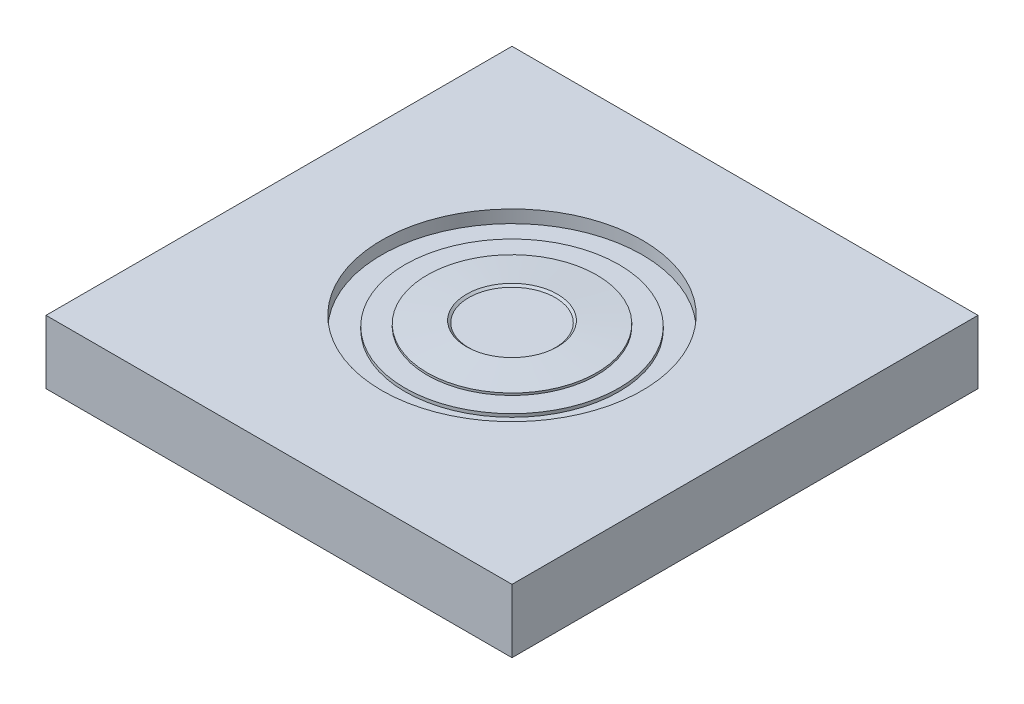
ISO-10303-21;
HEADER;
FILE_DESCRIPTION(('STEP AP214'),'2;1');
FILE_NAME('part.step','',(''),(''),'','','');
FILE_SCHEMA(('AUTOMOTIVE_DESIGN { 1 0 10303 214 1 1 1 1 }'));
ENDSEC;
DATA;
#1=APPLICATION_CONTEXT('core data for automotive mechanical design processes');
#2=APPLICATION_PROTOCOL_DEFINITION('international standard','automotive_design',2000,#1);
#3=PRODUCT_CONTEXT('',#1,'mechanical');
#4=PRODUCT('Part','Part','',(#3));
#5=PRODUCT_RELATED_PRODUCT_CATEGORY('part','',(#4));
#6=PRODUCT_DEFINITION_FORMATION('','',#4);
#7=PRODUCT_DEFINITION_CONTEXT('part definition',#1,'design');
#8=PRODUCT_DEFINITION('design','',#6,#7);
#9=PRODUCT_DEFINITION_SHAPE('','',#8);
#10=(LENGTH_UNIT() NAMED_UNIT(*) SI_UNIT(.MILLI.,.METRE.));
#11=(NAMED_UNIT(*) PLANE_ANGLE_UNIT() SI_UNIT($,.RADIAN.));
#12=(NAMED_UNIT(*) SI_UNIT($,.STERADIAN.) SOLID_ANGLE_UNIT());
#13=UNCERTAINTY_MEASURE_WITH_UNIT(LENGTH_MEASURE(1.E-05),#10,'distance_accuracy_value','');
#14=(GEOMETRIC_REPRESENTATION_CONTEXT(3) GLOBAL_UNCERTAINTY_ASSIGNED_CONTEXT((#13)) GLOBAL_UNIT_ASSIGNED_CONTEXT((#10,
#11,#12)) REPRESENTATION_CONTEXT('',''));
#15=CARTESIAN_POINT('',(0.,0.,0.));
#16=DIRECTION('',(0.,0.,1.));
#17=DIRECTION('',(1.,0.,0.));
#18=AXIS2_PLACEMENT_3D('',#15,#16,#17);
#19=CARTESIAN_POINT('',(0.,25.5,0.));
#20=DIRECTION('',(0.,1.,0.));
#21=DIRECTION('',(0.,0.,1.));
#22=AXIS2_PLACEMENT_3D('',#19,#20,#21);
#23=CYLINDRICAL_SURFACE('',#22,40.);
#24=CARTESIAN_POINT('',(0.,25.5,0.));
#25=DIRECTION('',(0.,1.,0.));
#26=DIRECTION('',(0.,0.,1.));
#27=AXIS2_PLACEMENT_3D('',#24,#25,#26);
#28=CIRCLE('',#27,40.);
#29=CARTESIAN_POINT('',(0.,25.5,40.));
#30=VERTEX_POINT('',#29);
#31=EDGE_CURVE('E122',#30,#30,#28,.T.);
#32=ORIENTED_EDGE('',*,*,#31,.T.);
#33=EDGE_LOOP('',(#32));
#34=FACE_BOUND('',#33,.T.);
#35=CARTESIAN_POINT('',(0.,26.5,0.));
#36=DIRECTION('',(0.,-1.,0.));
#37=DIRECTION('',(0.,0.,-1.));
#38=AXIS2_PLACEMENT_3D('',#35,#36,#37);
#39=CIRCLE('',#38,40.);
#40=CARTESIAN_POINT('',(0.,26.5,-40.));
#41=VERTEX_POINT('',#40);
#42=EDGE_CURVE('E119',#41,#41,#39,.F.);
#43=ORIENTED_EDGE('',*,*,#42,.F.);
#44=EDGE_LOOP('',(#43));
#45=FACE_BOUND('',#44,.T.);
#46=ADVANCED_FACE('F40',(#34,#45),#23,.T.);
#47=CARTESIAN_POINT('',(0.,24.,0.));
#48=DIRECTION('',(0.,1.,0.));
#49=DIRECTION('',(0.,0.,1.));
#50=AXIS2_PLACEMENT_3D('',#47,#48,#49);
#51=CYLINDRICAL_SURFACE('',#50,50.5);
#52=CARTESIAN_POINT('',(0.,24.,0.));
#53=DIRECTION('',(0.,1.,0.));
#54=DIRECTION('',(0.,0.,1.));
#55=AXIS2_PLACEMENT_3D('',#52,#53,#54);
#56=CIRCLE('',#55,50.5);
#57=CARTESIAN_POINT('',(0.,24.,50.5));
#58=VERTEX_POINT('',#57);
#59=EDGE_CURVE('E188',#58,#58,#56,.T.);
#60=ORIENTED_EDGE('',*,*,#59,.T.);
#61=EDGE_LOOP('',(#60));
#62=FACE_BOUND('',#61,.T.);
#63=CARTESIAN_POINT('',(0.,25.5,0.));
#64=DIRECTION('',(0.,1.,0.));
#65=DIRECTION('',(0.,0.,1.));
#66=AXIS2_PLACEMENT_3D('',#63,#64,#65);
#67=CIRCLE('',#66,50.5);
#68=CARTESIAN_POINT('',(0.,25.5,50.5));
#69=VERTEX_POINT('',#68);
#70=EDGE_CURVE('E193',#69,#69,#67,.T.);
#71=ORIENTED_EDGE('',*,*,#70,.F.);
#72=EDGE_LOOP('',(#71));
#73=FACE_BOUND('',#72,.T.);
#74=ADVANCED_FACE('F143',(#62,#73),#51,.T.);
#75=CARTESIAN_POINT('',(-110.,30.,110.));
#76=DIRECTION('',(1.,0.,0.));
#77=DIRECTION('',(0.,0.,-1.));
#78=AXIS2_PLACEMENT_3D('',#75,#76,#77);
#79=PLANE('',#78);
#80=DIRECTION('',(0.,0.,1.));
#81=VECTOR('',#80,1.);
#82=CARTESIAN_POINT('',(-110.,0.,110.));
#83=LINE('',#82,#81);
#84=CARTESIAN_POINT('',(-110.,0.,-110.));
#85=VERTEX_POINT('',#84);
#86=CARTESIAN_POINT('',(-110.,0.,110.));
#87=VERTEX_POINT('',#86);
#88=EDGE_CURVE('E109',#85,#87,#83,.T.);
#89=ORIENTED_EDGE('',*,*,#88,.T.);
#90=DIRECTION('',(0.,-1.,0.));
#91=VECTOR('',#90,1.);
#92=CARTESIAN_POINT('',(-110.,30.,110.));
#93=LINE('',#92,#91);
#94=CARTESIAN_POINT('',(-110.,30.,110.));
#95=VERTEX_POINT('',#94);
#96=EDGE_CURVE('E100',#95,#87,#93,.T.);
#97=ORIENTED_EDGE('',*,*,#96,.F.);
#98=DIRECTION('',(0.,0.,1.));
#99=VECTOR('',#98,1.);
#100=CARTESIAN_POINT('',(-110.,30.,110.));
#101=LINE('',#100,#99);
#102=CARTESIAN_POINT('',(-110.,30.,-110.));
#103=VERTEX_POINT('',#102);
#104=EDGE_CURVE('E94',#103,#95,#101,.T.);
#105=ORIENTED_EDGE('',*,*,#104,.F.);
#106=DIRECTION('',(0.,-1.,0.));
#107=VECTOR('',#106,1.);
#108=CARTESIAN_POINT('',(-110.,30.,-110.));
#109=LINE('',#108,#107);
#110=EDGE_CURVE('E105',#103,#85,#109,.T.);
#111=ORIENTED_EDGE('',*,*,#110,.T.);
#112=EDGE_LOOP('',(#89,#97,#105,#111));
#113=FACE_BOUND('',#112,.T.);
#114=ADVANCED_FACE('F149',(#113),#79,.F.);
#115=CARTESIAN_POINT('',(110.,30.,110.));
#116=DIRECTION('',(0.,0.,-1.));
#117=DIRECTION('',(-1.,0.,0.));
#118=AXIS2_PLACEMENT_3D('',#115,#116,#117);
#119=PLANE('',#118);
#120=DIRECTION('',(1.,0.,0.));
#121=VECTOR('',#120,1.);
#122=CARTESIAN_POINT('',(110.,0.,110.));
#123=LINE('',#122,#121);
#124=CARTESIAN_POINT('',(110.,0.,110.));
#125=VERTEX_POINT('',#124);
#126=EDGE_CURVE('E99',#87,#125,#123,.T.);
#127=ORIENTED_EDGE('',*,*,#126,.T.);
#128=DIRECTION('',(0.,-1.,0.));
#129=VECTOR('',#128,1.);
#130=CARTESIAN_POINT('',(110.,30.,110.));
#131=LINE('',#130,#129);
#132=CARTESIAN_POINT('',(110.,30.,110.));
#133=VERTEX_POINT('',#132);
#134=EDGE_CURVE('E97',#133,#125,#131,.T.);
#135=ORIENTED_EDGE('',*,*,#134,.F.);
#136=DIRECTION('',(1.,0.,0.));
#137=VECTOR('',#136,1.);
#138=CARTESIAN_POINT('',(110.,30.,110.));
#139=LINE('',#138,#137);
#140=EDGE_CURVE('E89',#95,#133,#139,.T.);
#141=ORIENTED_EDGE('',*,*,#140,.F.);
#142=ORIENTED_EDGE('',*,*,#96,.T.);
#143=EDGE_LOOP('',(#127,#135,#141,#142));
#144=FACE_BOUND('',#143,.T.);
#145=ADVANCED_FACE('F98',(#144),#119,.F.);
#146=CARTESIAN_POINT('',(110.,30.,110.));
#147=DIRECTION('',(-1.,0.,0.));
#148=DIRECTION('',(0.,0.,1.));
#149=AXIS2_PLACEMENT_3D('',#146,#147,#148);
#150=PLANE('',#149);
#151=DIRECTION('',(0.,0.,-1.));
#152=VECTOR('',#151,1.);
#153=CARTESIAN_POINT('',(110.,0.,110.));
#154=LINE('',#153,#152);
#155=CARTESIAN_POINT('',(110.,0.,-110.));
#156=VERTEX_POINT('',#155);
#157=EDGE_CURVE('E75',#125,#156,#154,.T.);
#158=ORIENTED_EDGE('',*,*,#157,.T.);
#159=DIRECTION('',(0.,-1.,0.));
#160=VECTOR('',#159,1.);
#161=CARTESIAN_POINT('',(110.,30.,-110.));
#162=LINE('',#161,#160);
#163=CARTESIAN_POINT('',(110.,30.,-110.));
#164=VERTEX_POINT('',#163);
#165=EDGE_CURVE('E101',#164,#156,#162,.T.);
#166=ORIENTED_EDGE('',*,*,#165,.F.);
#167=DIRECTION('',(0.,0.,-1.));
#168=VECTOR('',#167,1.);
#169=CARTESIAN_POINT('',(110.,30.,110.));
#170=LINE('',#169,#168);
#171=EDGE_CURVE('E92',#133,#164,#170,.T.);
#172=ORIENTED_EDGE('',*,*,#171,.F.);
#173=ORIENTED_EDGE('',*,*,#134,.T.);
#174=EDGE_LOOP('',(#158,#166,#172,#173));
#175=FACE_BOUND('',#174,.T.);
#176=ADVANCED_FACE('F103',(#175),#150,.F.);
#177=CARTESIAN_POINT('',(110.,30.,-110.));
#178=DIRECTION('',(0.,0.,1.));
#179=DIRECTION('',(1.,0.,0.));
#180=AXIS2_PLACEMENT_3D('',#177,#178,#179);
#181=PLANE('',#180);
#182=DIRECTION('',(-1.,0.,0.));
#183=VECTOR('',#182,1.);
#184=CARTESIAN_POINT('',(110.,0.,-110.));
#185=LINE('',#184,#183);
#186=EDGE_CURVE('E81',#156,#85,#185,.T.);
#187=ORIENTED_EDGE('',*,*,#186,.T.);
#188=ORIENTED_EDGE('',*,*,#110,.F.);
#189=DIRECTION('',(-1.,0.,0.));
#190=VECTOR('',#189,1.);
#191=CARTESIAN_POINT('',(110.,30.,-110.));
#192=LINE('',#191,#190);
#193=EDGE_CURVE('E58',#164,#103,#192,.T.);
#194=ORIENTED_EDGE('',*,*,#193,.F.);
#195=ORIENTED_EDGE('',*,*,#165,.T.);
#196=EDGE_LOOP('',(#187,#188,#194,#195));
#197=FACE_BOUND('',#196,.T.);
#198=ADVANCED_FACE('F169',(#197),#181,.F.);
#199=CARTESIAN_POINT('',(0.,30.,0.));
#200=DIRECTION('',(0.,1.,0.));
#201=DIRECTION('',(0.,0.,1.));
#202=AXIS2_PLACEMENT_3D('',#199,#200,#201);
#203=PLANE('',#202);
#204=CARTESIAN_POINT('',(0.,30.,0.));
#205=DIRECTION('',(0.,1.,0.));
#206=DIRECTION('',(0.,0.,1.));
#207=AXIS2_PLACEMENT_3D('',#204,#205,#206);
#208=CIRCLE('',#207,61.5);
#209=CARTESIAN_POINT('',(0.,30.,61.5));
#210=VERTEX_POINT('',#209);
#211=EDGE_CURVE('E185',#210,#210,#208,.T.);
#212=ORIENTED_EDGE('',*,*,#211,.F.);
#213=EDGE_LOOP('',(#212));
#214=FACE_BOUND('',#213,.T.);
#215=ORIENTED_EDGE('',*,*,#104,.T.);
#216=ORIENTED_EDGE('',*,*,#140,.T.);
#217=ORIENTED_EDGE('',*,*,#171,.T.);
#218=ORIENTED_EDGE('',*,*,#193,.T.);
#219=EDGE_LOOP('',(#215,#216,#217,#218));
#220=FACE_BOUND('',#219,.T.);
#221=ADVANCED_FACE('F90',(#214,#220),#203,.T.);
#222=CARTESIAN_POINT('',(0.,0.,0.));
#223=DIRECTION('',(0.,1.,0.));
#224=DIRECTION('',(0.,0.,1.));
#225=AXIS2_PLACEMENT_3D('',#222,#223,#224);
#226=PLANE('',#225);
#227=ORIENTED_EDGE('',*,*,#88,.F.);
#228=ORIENTED_EDGE('',*,*,#186,.F.);
#229=ORIENTED_EDGE('',*,*,#157,.F.);
#230=ORIENTED_EDGE('',*,*,#126,.F.);
#231=EDGE_LOOP('',(#227,#228,#229,#230));
#232=FACE_BOUND('',#231,.T.);
#233=ADVANCED_FACE('F165',(#232),#226,.F.);
#234=CARTESIAN_POINT('',(0.,24.,0.));
#235=DIRECTION('',(0.,1.,0.));
#236=DIRECTION('',(0.,0.,1.));
#237=AXIS2_PLACEMENT_3D('',#234,#235,#236);
#238=CYLINDRICAL_SURFACE('',#237,61.5);
#239=CARTESIAN_POINT('',(0.,24.,0.));
#240=DIRECTION('',(0.,1.,0.));
#241=DIRECTION('',(0.,0.,1.));
#242=AXIS2_PLACEMENT_3D('',#239,#240,#241);
#243=CIRCLE('',#242,61.5);
#244=CARTESIAN_POINT('',(0.,24.,61.5));
#245=VERTEX_POINT('',#244);
#246=EDGE_CURVE('E112',#245,#245,#243,.T.);
#247=ORIENTED_EDGE('',*,*,#246,.F.);
#248=EDGE_LOOP('',(#247));
#249=FACE_BOUND('',#248,.T.);
#250=ORIENTED_EDGE('',*,*,#211,.T.);
#251=EDGE_LOOP('',(#250));
#252=FACE_BOUND('',#251,.T.);
#253=ADVANCED_FACE('F161',(#249,#252),#238,.F.);
#254=CARTESIAN_POINT('',(0.,24.,0.));
#255=DIRECTION('',(0.,1.,0.));
#256=DIRECTION('',(0.,0.,1.));
#257=AXIS2_PLACEMENT_3D('',#254,#255,#256);
#258=PLANE('',#257);
#259=ORIENTED_EDGE('',*,*,#59,.F.);
#260=EDGE_LOOP('',(#259));
#261=FACE_BOUND('',#260,.T.);
#262=ORIENTED_EDGE('',*,*,#246,.T.);
#263=EDGE_LOOP('',(#262));
#264=FACE_BOUND('',#263,.T.);
#265=ADVANCED_FACE('F156',(#261,#264),#258,.T.);
#266=CARTESIAN_POINT('',(0.,25.5,0.));
#267=DIRECTION('',(0.,1.,0.));
#268=DIRECTION('',(0.,0.,1.));
#269=AXIS2_PLACEMENT_3D('',#266,#267,#268);
#270=PLANE('',#269);
#271=ORIENTED_EDGE('',*,*,#31,.F.);
#272=EDGE_LOOP('',(#271));
#273=FACE_BOUND('',#272,.T.);
#274=ORIENTED_EDGE('',*,*,#70,.T.);
#275=EDGE_LOOP('',(#274));
#276=FACE_BOUND('',#275,.T.);
#277=ADVANCED_FACE('F140',(#273,#276),#270,.T.);
#278=CARTESIAN_POINT('',(0.,28.,0.));
#279=DIRECTION('',(0.,-1.,0.));
#280=DIRECTION('',(0.,0.,-1.));
#281=AXIS2_PLACEMENT_3D('',#278,#279,#280);
#282=CONICAL_SURFACE('',#281,20.,1.49593647908413);
#283=CARTESIAN_POINT('',(0.,27.8878150776375,0.));
#284=DIRECTION('',(0.,-1.,0.));
#285=DIRECTION('',(0.,0.,-1.));
#286=AXIS2_PLACEMENT_3D('',#283,#284,#285);
#287=CIRCLE('',#286,21.4957989648327);
#288=CARTESIAN_POINT('',(0.,27.8878150776375,-21.4957989648327));
#289=VERTEX_POINT('',#288);
#290=EDGE_CURVE('E50',#289,#289,#287,.T.);
#291=ORIENTED_EDGE('',*,*,#290,.T.);
#292=EDGE_LOOP('',(#291));
#293=FACE_BOUND('',#292,.T.);
#294=ORIENTED_EDGE('',*,*,#42,.T.);
#295=EDGE_LOOP('',(#294));
#296=FACE_BOUND('',#295,.T.);
#297=ADVANCED_FACE('F127',(#293,#296),#282,.T.);
#298=CARTESIAN_POINT('',(0.,27.,0.));
#299=DIRECTION('',(0.,1.,0.));
#300=DIRECTION('',(0.,0.,1.));
#301=AXIS2_PLACEMENT_3D('',#298,#299,#300);
#302=PLANE('',#301);
#303=CARTESIAN_POINT('',(0.,27.,0.));
#304=DIRECTION('',(0.,1.,0.));
#305=DIRECTION('',(0.,0.,1.));
#306=AXIS2_PLACEMENT_3D('',#303,#304,#305);
#307=CIRCLE('',#306,20.4640138746053);
#308=CARTESIAN_POINT('',(0.,27.,20.4640138746053));
#309=VERTEX_POINT('',#308);
#310=EDGE_CURVE('E12',#309,#309,#307,.T.);
#311=ORIENTED_EDGE('',*,*,#310,.T.);
#312=EDGE_LOOP('',(#311));
#313=FACE_BOUND('',#312,.T.);
#314=ADVANCED_FACE('F132',(#313),#302,.T.);
#315=CARTESIAN_POINT('',(0.,26.6007322474327,0.));
#316=DIRECTION('',(0.,1.,0.));
#317=DIRECTION('',(0.,0.,1.));
#318=AXIS2_PLACEMENT_3D('',#315,#316,#317);
#319=CONICAL_SURFACE('',#318,20.,0.860258011108208);
#320=ORIENTED_EDGE('',*,*,#290,.F.);
#321=EDGE_LOOP('',(#320));
#322=FACE_BOUND('',#321,.T.);
#323=ORIENTED_EDGE('',*,*,#310,.F.);
#324=EDGE_LOOP('',(#323));
#325=FACE_BOUND('',#324,.T.);
#326=ADVANCED_FACE('F43',(#322,#325),#319,.F.);
#327=CLOSED_SHELL('',(#46,#74,#114,#145,#176,#198,#221,#233,#253,#265,#277,#297,#314,#326));
#328=MANIFOLD_SOLID_BREP('B2',#327);
#329=ADVANCED_BREP_SHAPE_REPRESENTATION('',(#18,#328),#14);
#330=SHAPE_DEFINITION_REPRESENTATION(#9,#329);
ENDSEC;
END-ISO-10303-21;
